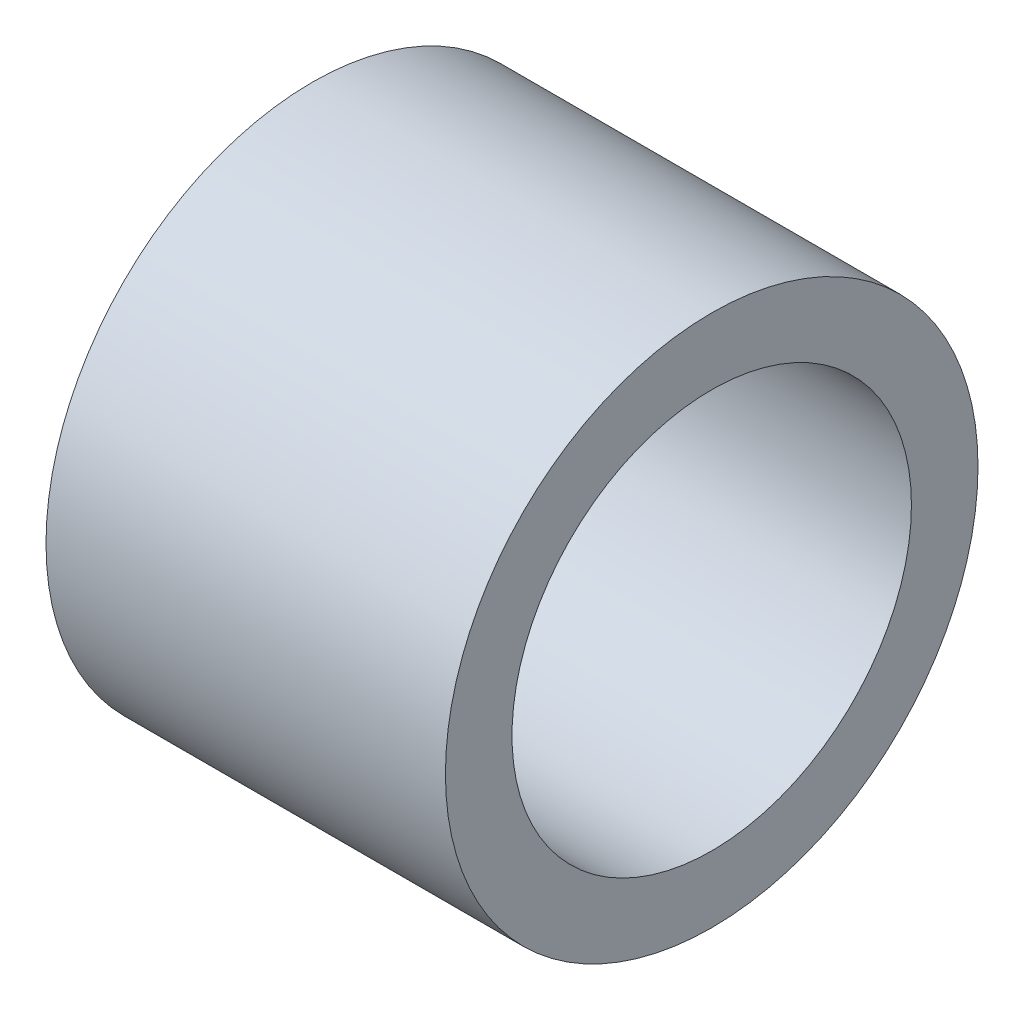
ISO-10303-21;
HEADER;
FILE_DESCRIPTION(('STEP AP214'),'2;1');
FILE_NAME('part.step','',(''),(''),'','','');
FILE_SCHEMA(('AUTOMOTIVE_DESIGN { 1 0 10303 214 1 1 1 1 }'));
ENDSEC;
DATA;
#1=APPLICATION_CONTEXT('core data for automotive mechanical design processes');
#2=APPLICATION_PROTOCOL_DEFINITION('international standard','automotive_design',2000,#1);
#3=PRODUCT_CONTEXT('',#1,'mechanical');
#4=PRODUCT('Part','Part','',(#3));
#5=PRODUCT_RELATED_PRODUCT_CATEGORY('part','',(#4));
#6=PRODUCT_DEFINITION_FORMATION('','',#4);
#7=PRODUCT_DEFINITION_CONTEXT('part definition',#1,'design');
#8=PRODUCT_DEFINITION('design','',#6,#7);
#9=PRODUCT_DEFINITION_SHAPE('','',#8);
#10=(LENGTH_UNIT() NAMED_UNIT(*) SI_UNIT(.MILLI.,.METRE.));
#11=(NAMED_UNIT(*) PLANE_ANGLE_UNIT() SI_UNIT($,.RADIAN.));
#12=(NAMED_UNIT(*) SI_UNIT($,.STERADIAN.) SOLID_ANGLE_UNIT());
#13=UNCERTAINTY_MEASURE_WITH_UNIT(LENGTH_MEASURE(1.E-05),#10,'distance_accuracy_value','');
#14=(GEOMETRIC_REPRESENTATION_CONTEXT(3) GLOBAL_UNCERTAINTY_ASSIGNED_CONTEXT((#13)) GLOBAL_UNIT_ASSIGNED_CONTEXT((#10,
#11,#12)) REPRESENTATION_CONTEXT('',''));
#15=CARTESIAN_POINT('',(0.,0.,0.));
#16=DIRECTION('',(0.,0.,1.));
#17=DIRECTION('',(1.,0.,0.));
#18=AXIS2_PLACEMENT_3D('',#15,#16,#17);
#19=CARTESIAN_POINT('',(9.525,0.,0.));
#20=DIRECTION('',(1.,0.,0.));
#21=DIRECTION('',(0.,0.,-1.));
#22=AXIS2_PLACEMENT_3D('',#19,#20,#21);
#23=PLANE('',#22);
#24=CARTESIAN_POINT('',(9.525,0.,0.));
#25=DIRECTION('',(1.,0.,0.));
#26=DIRECTION('',(0.,0.,-1.));
#27=AXIS2_PLACEMENT_3D('',#24,#25,#26);
#28=CIRCLE('',#27,12.7);
#29=CARTESIAN_POINT('',(9.525,0.,-12.7));
#30=VERTEX_POINT('',#29);
#31=EDGE_CURVE('E10',#30,#30,#28,.T.);
#32=ORIENTED_EDGE('',*,*,#31,.T.);
#33=EDGE_LOOP('',(#32));
#34=FACE_BOUND('',#33,.T.);
#35=CARTESIAN_POINT('',(9.525,0.,0.));
#36=DIRECTION('',(1.,0.,0.));
#37=DIRECTION('',(0.,0.,-1.));
#38=AXIS2_PLACEMENT_3D('',#35,#36,#37);
#39=CIRCLE('',#38,9.525);
#40=CARTESIAN_POINT('',(9.525,0.,-9.525));
#41=VERTEX_POINT('',#40);
#42=EDGE_CURVE('E54',#41,#41,#39,.T.);
#43=ORIENTED_EDGE('',*,*,#42,.F.);
#44=EDGE_LOOP('',(#43));
#45=FACE_BOUND('',#44,.T.);
#46=ADVANCED_FACE('F41',(#34,#45),#23,.T.);
#47=CARTESIAN_POINT('',(-9.525,0.,0.));
#48=DIRECTION('',(1.,0.,0.));
#49=DIRECTION('',(0.,0.,-1.));
#50=AXIS2_PLACEMENT_3D('',#47,#48,#49);
#51=PLANE('',#50);
#52=CARTESIAN_POINT('',(-9.525,0.,0.));
#53=DIRECTION('',(1.,0.,0.));
#54=DIRECTION('',(0.,0.,-1.));
#55=AXIS2_PLACEMENT_3D('',#52,#53,#54);
#56=CIRCLE('',#55,12.7);
#57=CARTESIAN_POINT('',(-9.525,0.,-12.7));
#58=VERTEX_POINT('',#57);
#59=EDGE_CURVE('E45',#58,#58,#56,.T.);
#60=ORIENTED_EDGE('',*,*,#59,.F.);
#61=EDGE_LOOP('',(#60));
#62=FACE_BOUND('',#61,.T.);
#63=CARTESIAN_POINT('',(-9.525,0.,0.));
#64=DIRECTION('',(1.,0.,0.));
#65=DIRECTION('',(0.,0.,-1.));
#66=AXIS2_PLACEMENT_3D('',#63,#64,#65);
#67=CIRCLE('',#66,9.525);
#68=CARTESIAN_POINT('',(-9.525,0.,-9.525));
#69=VERTEX_POINT('',#68);
#70=EDGE_CURVE('E56',#69,#69,#67,.T.);
#71=ORIENTED_EDGE('',*,*,#70,.T.);
#72=EDGE_LOOP('',(#71));
#73=FACE_BOUND('',#72,.T.);
#74=ADVANCED_FACE('F68',(#62,#73),#51,.F.);
#75=CARTESIAN_POINT('',(9.525,0.,0.));
#76=DIRECTION('',(-1.,0.,0.));
#77=DIRECTION('',(0.,0.,1.));
#78=AXIS2_PLACEMENT_3D('',#75,#76,#77);
#79=CYLINDRICAL_SURFACE('',#78,12.7);
#80=ORIENTED_EDGE('',*,*,#31,.F.);
#81=EDGE_LOOP('',(#80));
#82=FACE_BOUND('',#81,.T.);
#83=ORIENTED_EDGE('',*,*,#59,.T.);
#84=EDGE_LOOP('',(#83));
#85=FACE_BOUND('',#84,.T.);
#86=ADVANCED_FACE('F43',(#82,#85),#79,.T.);
#87=CARTESIAN_POINT('',(9.525,0.,0.));
#88=DIRECTION('',(-1.,0.,0.));
#89=DIRECTION('',(0.,0.,1.));
#90=AXIS2_PLACEMENT_3D('',#87,#88,#89);
#91=CYLINDRICAL_SURFACE('',#90,9.525);
#92=ORIENTED_EDGE('',*,*,#42,.T.);
#93=EDGE_LOOP('',(#92));
#94=FACE_BOUND('',#93,.T.);
#95=ORIENTED_EDGE('',*,*,#70,.F.);
#96=EDGE_LOOP('',(#95));
#97=FACE_BOUND('',#96,.T.);
#98=ADVANCED_FACE('F64',(#94,#97),#91,.F.);
#99=CLOSED_SHELL('',(#46,#74,#86,#98));
#100=MANIFOLD_SOLID_BREP('B2',#99);
#101=ADVANCED_BREP_SHAPE_REPRESENTATION('',(#18,#100),#14);
#102=SHAPE_DEFINITION_REPRESENTATION(#9,#101);
ENDSEC;
END-ISO-10303-21;
